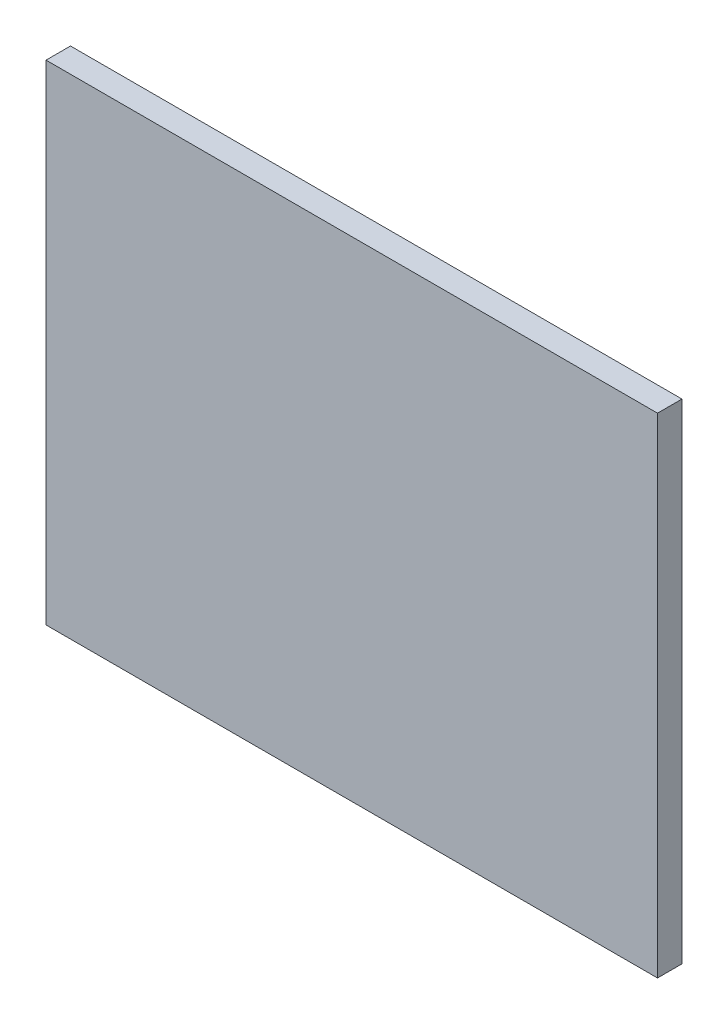
ISO-10303-21;
HEADER;
FILE_DESCRIPTION(('STEP AP214'),'2;1');
FILE_NAME('part.step','',(''),(''),'','','');
FILE_SCHEMA(('AUTOMOTIVE_DESIGN { 1 0 10303 214 1 1 1 1 }'));
ENDSEC;
DATA;
#1=APPLICATION_CONTEXT('core data for automotive mechanical design processes');
#2=APPLICATION_PROTOCOL_DEFINITION('international standard','automotive_design',2000,#1);
#3=PRODUCT_CONTEXT('',#1,'mechanical');
#4=PRODUCT('Part','Part','',(#3));
#5=PRODUCT_RELATED_PRODUCT_CATEGORY('part','',(#4));
#6=PRODUCT_DEFINITION_FORMATION('','',#4);
#7=PRODUCT_DEFINITION_CONTEXT('part definition',#1,'design');
#8=PRODUCT_DEFINITION('design','',#6,#7);
#9=PRODUCT_DEFINITION_SHAPE('','',#8);
#10=(LENGTH_UNIT() NAMED_UNIT(*) SI_UNIT(.MILLI.,.METRE.));
#11=(NAMED_UNIT(*) PLANE_ANGLE_UNIT() SI_UNIT($,.RADIAN.));
#12=(NAMED_UNIT(*) SI_UNIT($,.STERADIAN.) SOLID_ANGLE_UNIT());
#13=UNCERTAINTY_MEASURE_WITH_UNIT(LENGTH_MEASURE(1.E-05),#10,'distance_accuracy_value','');
#14=(GEOMETRIC_REPRESENTATION_CONTEXT(3) GLOBAL_UNCERTAINTY_ASSIGNED_CONTEXT((#13)) GLOBAL_UNIT_ASSIGNED_CONTEXT((#10,
#11,#12)) REPRESENTATION_CONTEXT('',''));
#15=CARTESIAN_POINT('',(0.,0.,0.));
#16=DIRECTION('',(0.,0.,1.));
#17=DIRECTION('',(1.,0.,0.));
#18=AXIS2_PLACEMENT_3D('',#15,#16,#17);
#19=CARTESIAN_POINT('',(-12.5,-10.,1.));
#20=DIRECTION('',(1.,0.,0.));
#21=DIRECTION('',(0.,0.,-1.));
#22=AXIS2_PLACEMENT_3D('',#19,#20,#21);
#23=PLANE('',#22);
#24=DIRECTION('',(0.,-1.,0.));
#25=VECTOR('',#24,1.);
#26=CARTESIAN_POINT('',(-12.5,-10.,0.));
#27=LINE('',#26,#25);
#28=CARTESIAN_POINT('',(-12.5,10.,0.));
#29=VERTEX_POINT('',#28);
#30=CARTESIAN_POINT('',(-12.5,-10.,0.));
#31=VERTEX_POINT('',#30);
#32=EDGE_CURVE('E96',#29,#31,#27,.T.);
#33=ORIENTED_EDGE('',*,*,#32,.T.);
#34=DIRECTION('',(0.,0.,-1.));
#35=VECTOR('',#34,1.);
#36=CARTESIAN_POINT('',(-12.5,-10.,1.));
#37=LINE('',#36,#35);
#38=CARTESIAN_POINT('',(-12.5,-10.,1.));
#39=VERTEX_POINT('',#38);
#40=EDGE_CURVE('E11',#39,#31,#37,.T.);
#41=ORIENTED_EDGE('',*,*,#40,.F.);
#42=DIRECTION('',(0.,-1.,0.));
#43=VECTOR('',#42,1.);
#44=CARTESIAN_POINT('',(-12.5,-10.,1.));
#45=LINE('',#44,#43);
#46=CARTESIAN_POINT('',(-12.5,10.,1.));
#47=VERTEX_POINT('',#46);
#48=EDGE_CURVE('E84',#47,#39,#45,.T.);
#49=ORIENTED_EDGE('',*,*,#48,.F.);
#50=DIRECTION('',(0.,0.,-1.));
#51=VECTOR('',#50,1.);
#52=CARTESIAN_POINT('',(-12.5,10.,1.));
#53=LINE('',#52,#51);
#54=EDGE_CURVE('E92',#47,#29,#53,.T.);
#55=ORIENTED_EDGE('',*,*,#54,.T.);
#56=EDGE_LOOP('',(#33,#41,#49,#55));
#57=FACE_BOUND('',#56,.T.);
#58=ADVANCED_FACE('F33',(#57),#23,.F.);
#59=CARTESIAN_POINT('',(12.5,-10.,1.));
#60=DIRECTION('',(0.,1.,0.));
#61=DIRECTION('',(-1.,0.,0.));
#62=AXIS2_PLACEMENT_3D('',#59,#60,#61);
#63=PLANE('',#62);
#64=DIRECTION('',(1.,0.,0.));
#65=VECTOR('',#64,1.);
#66=CARTESIAN_POINT('',(12.5,-10.,0.));
#67=LINE('',#66,#65);
#68=CARTESIAN_POINT('',(12.5,-10.,0.));
#69=VERTEX_POINT('',#68);
#70=EDGE_CURVE('E88',#31,#69,#67,.T.);
#71=ORIENTED_EDGE('',*,*,#70,.T.);
#72=DIRECTION('',(0.,0.,-1.));
#73=VECTOR('',#72,1.);
#74=CARTESIAN_POINT('',(12.5,-10.,1.));
#75=LINE('',#74,#73);
#76=CARTESIAN_POINT('',(12.5,-10.,1.));
#77=VERTEX_POINT('',#76);
#78=EDGE_CURVE('E41',#77,#69,#75,.T.);
#79=ORIENTED_EDGE('',*,*,#78,.F.);
#80=DIRECTION('',(1.,0.,0.));
#81=VECTOR('',#80,1.);
#82=CARTESIAN_POINT('',(12.5,-10.,1.));
#83=LINE('',#82,#81);
#84=EDGE_CURVE('E79',#39,#77,#83,.T.);
#85=ORIENTED_EDGE('',*,*,#84,.F.);
#86=ORIENTED_EDGE('',*,*,#40,.T.);
#87=EDGE_LOOP('',(#71,#79,#85,#86));
#88=FACE_BOUND('',#87,.T.);
#89=ADVANCED_FACE('F87',(#88),#63,.F.);
#90=CARTESIAN_POINT('',(12.5,-10.,1.));
#91=DIRECTION('',(-1.,0.,0.));
#92=DIRECTION('',(0.,0.,1.));
#93=AXIS2_PLACEMENT_3D('',#90,#91,#92);
#94=PLANE('',#93);
#95=DIRECTION('',(0.,1.,0.));
#96=VECTOR('',#95,1.);
#97=CARTESIAN_POINT('',(12.5,-10.,0.));
#98=LINE('',#97,#96);
#99=CARTESIAN_POINT('',(12.5,10.,0.));
#100=VERTEX_POINT('',#99);
#101=EDGE_CURVE('E66',#69,#100,#98,.T.);
#102=ORIENTED_EDGE('',*,*,#101,.T.);
#103=DIRECTION('',(0.,0.,-1.));
#104=VECTOR('',#103,1.);
#105=CARTESIAN_POINT('',(12.5,10.,1.));
#106=LINE('',#105,#104);
#107=CARTESIAN_POINT('',(12.5,10.,1.));
#108=VERTEX_POINT('',#107);
#109=EDGE_CURVE('E89',#108,#100,#106,.T.);
#110=ORIENTED_EDGE('',*,*,#109,.F.);
#111=DIRECTION('',(0.,1.,0.));
#112=VECTOR('',#111,1.);
#113=CARTESIAN_POINT('',(12.5,-10.,1.));
#114=LINE('',#113,#112);
#115=EDGE_CURVE('E82',#77,#108,#114,.T.);
#116=ORIENTED_EDGE('',*,*,#115,.F.);
#117=ORIENTED_EDGE('',*,*,#78,.T.);
#118=EDGE_LOOP('',(#102,#110,#116,#117));
#119=FACE_BOUND('',#118,.T.);
#120=ADVANCED_FACE('F90',(#119),#94,.F.);
#121=CARTESIAN_POINT('',(12.5,10.,1.));
#122=DIRECTION('',(0.,-1.,0.));
#123=DIRECTION('',(1.,0.,0.));
#124=AXIS2_PLACEMENT_3D('',#121,#122,#123);
#125=PLANE('',#124);
#126=DIRECTION('',(-1.,0.,0.));
#127=VECTOR('',#126,1.);
#128=CARTESIAN_POINT('',(12.5,10.,0.));
#129=LINE('',#128,#127);
#130=EDGE_CURVE('E72',#100,#29,#129,.T.);
#131=ORIENTED_EDGE('',*,*,#130,.T.);
#132=ORIENTED_EDGE('',*,*,#54,.F.);
#133=DIRECTION('',(-1.,0.,0.));
#134=VECTOR('',#133,1.);
#135=CARTESIAN_POINT('',(12.5,10.,1.));
#136=LINE('',#135,#134);
#137=EDGE_CURVE('E49',#108,#47,#136,.T.);
#138=ORIENTED_EDGE('',*,*,#137,.F.);
#139=ORIENTED_EDGE('',*,*,#109,.T.);
#140=EDGE_LOOP('',(#131,#132,#138,#139));
#141=FACE_BOUND('',#140,.T.);
#142=ADVANCED_FACE('F103',(#141),#125,.F.);
#143=CARTESIAN_POINT('',(0.,0.,1.));
#144=DIRECTION('',(0.,0.,1.));
#145=DIRECTION('',(1.,0.,0.));
#146=AXIS2_PLACEMENT_3D('',#143,#144,#145);
#147=PLANE('',#146);
#148=ORIENTED_EDGE('',*,*,#48,.T.);
#149=ORIENTED_EDGE('',*,*,#84,.T.);
#150=ORIENTED_EDGE('',*,*,#115,.T.);
#151=ORIENTED_EDGE('',*,*,#137,.T.);
#152=EDGE_LOOP('',(#148,#149,#150,#151));
#153=FACE_BOUND('',#152,.T.);
#154=ADVANCED_FACE('F80',(#153),#147,.T.);
#155=CARTESIAN_POINT('',(0.,0.,0.));
#156=DIRECTION('',(0.,0.,1.));
#157=DIRECTION('',(1.,0.,0.));
#158=AXIS2_PLACEMENT_3D('',#155,#156,#157);
#159=PLANE('',#158);
#160=ORIENTED_EDGE('',*,*,#32,.F.);
#161=ORIENTED_EDGE('',*,*,#130,.F.);
#162=ORIENTED_EDGE('',*,*,#101,.F.);
#163=ORIENTED_EDGE('',*,*,#70,.F.);
#164=EDGE_LOOP('',(#160,#161,#162,#163));
#165=FACE_BOUND('',#164,.T.);
#166=ADVANCED_FACE('F106',(#165),#159,.F.);
#167=CLOSED_SHELL('',(#58,#89,#120,#142,#154,#166));
#168=MANIFOLD_SOLID_BREP('B2',#167);
#169=ADVANCED_BREP_SHAPE_REPRESENTATION('',(#18,#168),#14);
#170=SHAPE_DEFINITION_REPRESENTATION(#9,#169);
ENDSEC;
END-ISO-10303-21;
